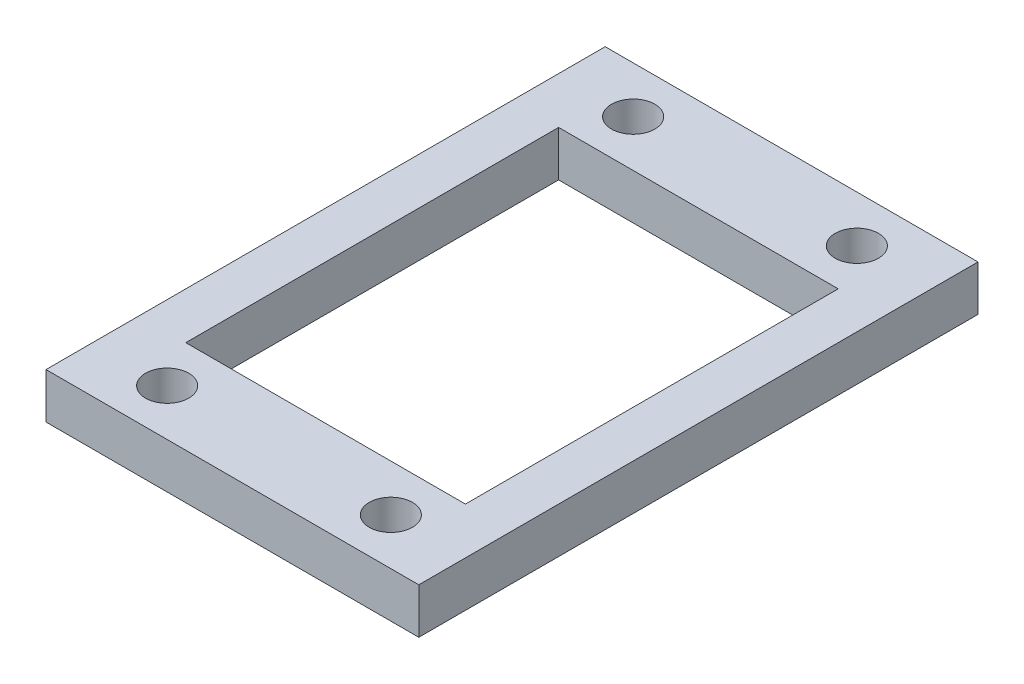
ISO-10303-21;
HEADER;
FILE_DESCRIPTION(('STEP AP214'),'2;1');
FILE_NAME('part.step','',(''),(''),'','','');
FILE_SCHEMA(('AUTOMOTIVE_DESIGN { 1 0 10303 214 1 1 1 1 }'));
ENDSEC;
DATA;
#1=APPLICATION_CONTEXT('core data for automotive mechanical design processes');
#2=APPLICATION_PROTOCOL_DEFINITION('international standard','automotive_design',2000,#1);
#3=PRODUCT_CONTEXT('',#1,'mechanical');
#4=PRODUCT('Part','Part','',(#3));
#5=PRODUCT_RELATED_PRODUCT_CATEGORY('part','',(#4));
#6=PRODUCT_DEFINITION_FORMATION('','',#4);
#7=PRODUCT_DEFINITION_CONTEXT('part definition',#1,'design');
#8=PRODUCT_DEFINITION('design','',#6,#7);
#9=PRODUCT_DEFINITION_SHAPE('','',#8);
#10=(LENGTH_UNIT() NAMED_UNIT(*) SI_UNIT(.MILLI.,.METRE.));
#11=(NAMED_UNIT(*) PLANE_ANGLE_UNIT() SI_UNIT($,.RADIAN.));
#12=(NAMED_UNIT(*) SI_UNIT($,.STERADIAN.) SOLID_ANGLE_UNIT());
#13=UNCERTAINTY_MEASURE_WITH_UNIT(LENGTH_MEASURE(1.E-05),#10,'distance_accuracy_value','');
#14=(GEOMETRIC_REPRESENTATION_CONTEXT(3) GLOBAL_UNCERTAINTY_ASSIGNED_CONTEXT((#13)) GLOBAL_UNIT_ASSIGNED_CONTEXT((#10,
#11,#12)) REPRESENTATION_CONTEXT('',''));
#15=CARTESIAN_POINT('',(0.,0.,0.));
#16=DIRECTION('',(0.,0.,1.));
#17=DIRECTION('',(1.,0.,0.));
#18=AXIS2_PLACEMENT_3D('',#15,#16,#17);
#19=CARTESIAN_POINT('',(-25.4,3.0988,19.05));
#20=DIRECTION('',(0.,1.,0.));
#21=DIRECTION('',(0.,0.,1.));
#22=AXIS2_PLACEMENT_3D('',#19,#20,#21);
#23=PLANE('',#22);
#24=CARTESIAN_POINT('',(-5.08000000000001,3.0988,15.875));
#25=DIRECTION('',(0.,1.,0.));
#26=DIRECTION('',(0.,0.,-1.));
#27=AXIS2_PLACEMENT_3D('',#24,#25,#26);
#28=CIRCLE('',#27,1.4732);
#29=CARTESIAN_POINT('',(-5.08000000000001,3.0988,14.4018));
#30=VERTEX_POINT('',#29);
#31=EDGE_CURVE('E133',#30,#30,#28,.T.);
#32=ORIENTED_EDGE('',*,*,#31,.F.);
#33=EDGE_LOOP('',(#32));
#34=FACE_BOUND('',#33,.T.);
#35=CARTESIAN_POINT('',(-20.32,3.0988,15.875));
#36=DIRECTION('',(0.,1.,0.));
#37=DIRECTION('',(0.,0.,1.));
#38=AXIS2_PLACEMENT_3D('',#35,#36,#37);
#39=CIRCLE('',#38,1.4732);
#40=CARTESIAN_POINT('',(-20.32,3.0988,17.3482));
#41=VERTEX_POINT('',#40);
#42=EDGE_CURVE('E145',#41,#41,#39,.T.);
#43=ORIENTED_EDGE('',*,*,#42,.F.);
#44=EDGE_LOOP('',(#43));
#45=FACE_BOUND('',#44,.T.);
#46=DIRECTION('',(0.,0.,1.));
#47=VECTOR('',#46,1.);
#48=CARTESIAN_POINT('',(-25.4,3.0988,-19.05));
#49=LINE('',#48,#47);
#50=CARTESIAN_POINT('',(-25.4,3.0988,-19.05));
#51=VERTEX_POINT('',#50);
#52=CARTESIAN_POINT('',(-25.4,3.0988,19.05));
#53=VERTEX_POINT('',#52);
#54=EDGE_CURVE('E157',#51,#53,#49,.T.);
#55=ORIENTED_EDGE('',*,*,#54,.T.);
#56=DIRECTION('',(1.,0.,0.));
#57=VECTOR('',#56,1.);
#58=CARTESIAN_POINT('',(-25.4,3.0988,19.05));
#59=LINE('',#58,#57);
#60=CARTESIAN_POINT('',(0.,3.0988,19.05));
#61=VERTEX_POINT('',#60);
#62=EDGE_CURVE('E160',#53,#61,#59,.T.);
#63=ORIENTED_EDGE('',*,*,#62,.T.);
#64=DIRECTION('',(0.,0.,-1.));
#65=VECTOR('',#64,1.);
#66=CARTESIAN_POINT('',(0.,3.0988,-19.05));
#67=LINE('',#66,#65);
#68=CARTESIAN_POINT('',(0.,3.0988,-19.05));
#69=VERTEX_POINT('',#68);
#70=EDGE_CURVE('E163',#61,#69,#67,.T.);
#71=ORIENTED_EDGE('',*,*,#70,.T.);
#72=DIRECTION('',(-1.,0.,0.));
#73=VECTOR('',#72,1.);
#74=CARTESIAN_POINT('',(-25.4,3.0988,-19.05));
#75=LINE('',#74,#73);
#76=EDGE_CURVE('E165',#69,#51,#75,.T.);
#77=ORIENTED_EDGE('',*,*,#76,.T.);
#78=EDGE_LOOP('',(#55,#63,#71,#77));
#79=FACE_BOUND('',#78,.T.);
#80=CARTESIAN_POINT('',(-5.08000000000001,3.0988,-15.875));
#81=DIRECTION('',(0.,1.,0.));
#82=DIRECTION('',(0.,0.,1.));
#83=AXIS2_PLACEMENT_3D('',#80,#81,#82);
#84=CIRCLE('',#83,1.4732);
#85=CARTESIAN_POINT('',(-5.08000000000001,3.0988,-14.4018));
#86=VERTEX_POINT('',#85);
#87=EDGE_CURVE('E151',#86,#86,#84,.T.);
#88=ORIENTED_EDGE('',*,*,#87,.F.);
#89=EDGE_LOOP('',(#88));
#90=FACE_BOUND('',#89,.T.);
#91=CARTESIAN_POINT('',(-20.32,3.0988,-15.875));
#92=DIRECTION('',(0.,1.,0.));
#93=DIRECTION('',(0.,0.,-1.));
#94=AXIS2_PLACEMENT_3D('',#91,#92,#93);
#95=CIRCLE('',#94,1.4732);
#96=CARTESIAN_POINT('',(-20.32,3.0988,-17.3482));
#97=VERTEX_POINT('',#96);
#98=EDGE_CURVE('E139',#97,#97,#95,.T.);
#99=ORIENTED_EDGE('',*,*,#98,.F.);
#100=EDGE_LOOP('',(#99));
#101=FACE_BOUND('',#100,.T.);
#102=DIRECTION('',(-1.,0.,0.));
#103=VECTOR('',#102,1.);
#104=CARTESIAN_POINT('',(-22.225,3.0988,-12.7));
#105=LINE('',#104,#103);
#106=CARTESIAN_POINT('',(-3.17500000000001,3.0988,-12.7));
#107=VERTEX_POINT('',#106);
#108=CARTESIAN_POINT('',(-22.225,3.0988,-12.7));
#109=VERTEX_POINT('',#108);
#110=EDGE_CURVE('E105',#107,#109,#105,.T.);
#111=ORIENTED_EDGE('',*,*,#110,.F.);
#112=DIRECTION('',(0.,0.,-1.));
#113=VECTOR('',#112,1.);
#114=CARTESIAN_POINT('',(-3.175,3.0988,12.7));
#115=LINE('',#114,#113);
#116=CARTESIAN_POINT('',(-3.175,3.0988,12.7));
#117=VERTEX_POINT('',#116);
#118=EDGE_CURVE('E97',#117,#107,#115,.T.);
#119=ORIENTED_EDGE('',*,*,#118,.F.);
#120=DIRECTION('',(1.,0.,0.));
#121=VECTOR('',#120,1.);
#122=CARTESIAN_POINT('',(-22.225,3.0988,12.7));
#123=LINE('',#122,#121);
#124=CARTESIAN_POINT('',(-22.225,3.0988,12.7));
#125=VERTEX_POINT('',#124);
#126=EDGE_CURVE('E119',#125,#117,#123,.T.);
#127=ORIENTED_EDGE('',*,*,#126,.F.);
#128=DIRECTION('',(0.,0.,1.));
#129=VECTOR('',#128,1.);
#130=CARTESIAN_POINT('',(-22.225,3.0988,12.7));
#131=LINE('',#130,#129);
#132=EDGE_CURVE('E117',#109,#125,#131,.T.);
#133=ORIENTED_EDGE('',*,*,#132,.F.);
#134=EDGE_LOOP('',(#111,#119,#127,#133));
#135=FACE_BOUND('',#134,.T.);
#136=ADVANCED_FACE('F32',(#34,#45,#79,#90,#101,#135),#23,.T.);
#137=CARTESIAN_POINT('',(-25.4,0.,19.05));
#138=DIRECTION('',(0.,1.,0.));
#139=DIRECTION('',(0.,0.,1.));
#140=AXIS2_PLACEMENT_3D('',#137,#138,#139);
#141=PLANE('',#140);
#142=CARTESIAN_POINT('',(-5.08000000000001,0.,15.875));
#143=DIRECTION('',(0.,1.,0.));
#144=DIRECTION('',(0.,0.,-1.));
#145=AXIS2_PLACEMENT_3D('',#142,#143,#144);
#146=CIRCLE('',#145,1.4732);
#147=CARTESIAN_POINT('',(-5.08000000000001,0.,14.4018));
#148=VERTEX_POINT('',#147);
#149=EDGE_CURVE('E113',#148,#148,#146,.T.);
#150=ORIENTED_EDGE('',*,*,#149,.T.);
#151=EDGE_LOOP('',(#150));
#152=FACE_BOUND('',#151,.T.);
#153=CARTESIAN_POINT('',(-20.32,0.,15.875));
#154=DIRECTION('',(0.,1.,0.));
#155=DIRECTION('',(0.,0.,1.));
#156=AXIS2_PLACEMENT_3D('',#153,#154,#155);
#157=CIRCLE('',#156,1.4732);
#158=CARTESIAN_POINT('',(-20.32,0.,17.3482));
#159=VERTEX_POINT('',#158);
#160=EDGE_CURVE('E142',#159,#159,#157,.T.);
#161=ORIENTED_EDGE('',*,*,#160,.T.);
#162=EDGE_LOOP('',(#161));
#163=FACE_BOUND('',#162,.T.);
#164=DIRECTION('',(0.,0.,1.));
#165=VECTOR('',#164,1.);
#166=CARTESIAN_POINT('',(-25.4,0.,-19.05));
#167=LINE('',#166,#165);
#168=CARTESIAN_POINT('',(-25.4,0.,-19.05));
#169=VERTEX_POINT('',#168);
#170=CARTESIAN_POINT('',(-25.4,0.,19.05));
#171=VERTEX_POINT('',#170);
#172=EDGE_CURVE('E154',#169,#171,#167,.T.);
#173=ORIENTED_EDGE('',*,*,#172,.F.);
#174=DIRECTION('',(-1.,0.,0.));
#175=VECTOR('',#174,1.);
#176=CARTESIAN_POINT('',(-25.4,0.,-19.05));
#177=LINE('',#176,#175);
#178=CARTESIAN_POINT('',(0.,0.,-19.05));
#179=VERTEX_POINT('',#178);
#180=EDGE_CURVE('E161',#179,#169,#177,.T.);
#181=ORIENTED_EDGE('',*,*,#180,.F.);
#182=DIRECTION('',(0.,0.,-1.));
#183=VECTOR('',#182,1.);
#184=CARTESIAN_POINT('',(0.,0.,-19.05));
#185=LINE('',#184,#183);
#186=CARTESIAN_POINT('',(0.,0.,19.05));
#187=VERTEX_POINT('',#186);
#188=EDGE_CURVE('E172',#187,#179,#185,.T.);
#189=ORIENTED_EDGE('',*,*,#188,.F.);
#190=DIRECTION('',(1.,0.,0.));
#191=VECTOR('',#190,1.);
#192=CARTESIAN_POINT('',(-25.4,0.,19.05));
#193=LINE('',#192,#191);
#194=EDGE_CURVE('E170',#171,#187,#193,.T.);
#195=ORIENTED_EDGE('',*,*,#194,.F.);
#196=EDGE_LOOP('',(#173,#181,#189,#195));
#197=FACE_BOUND('',#196,.T.);
#198=CARTESIAN_POINT('',(-5.08000000000001,0.,-15.875));
#199=DIRECTION('',(0.,1.,0.));
#200=DIRECTION('',(0.,0.,1.));
#201=AXIS2_PLACEMENT_3D('',#198,#199,#200);
#202=CIRCLE('',#201,1.4732);
#203=CARTESIAN_POINT('',(-5.08000000000001,0.,-14.4018));
#204=VERTEX_POINT('',#203);
#205=EDGE_CURVE('E148',#204,#204,#202,.T.);
#206=ORIENTED_EDGE('',*,*,#205,.T.);
#207=EDGE_LOOP('',(#206));
#208=FACE_BOUND('',#207,.T.);
#209=CARTESIAN_POINT('',(-20.32,0.,-15.875));
#210=DIRECTION('',(0.,1.,0.));
#211=DIRECTION('',(0.,0.,-1.));
#212=AXIS2_PLACEMENT_3D('',#209,#210,#211);
#213=CIRCLE('',#212,1.4732);
#214=CARTESIAN_POINT('',(-20.32,0.,-17.3482));
#215=VERTEX_POINT('',#214);
#216=EDGE_CURVE('E136',#215,#215,#213,.T.);
#217=ORIENTED_EDGE('',*,*,#216,.T.);
#218=EDGE_LOOP('',(#217));
#219=FACE_BOUND('',#218,.T.);
#220=DIRECTION('',(0.,0.,-1.));
#221=VECTOR('',#220,1.);
#222=CARTESIAN_POINT('',(-3.175,0.,12.7));
#223=LINE('',#222,#221);
#224=CARTESIAN_POINT('',(-3.175,0.,12.7));
#225=VERTEX_POINT('',#224);
#226=CARTESIAN_POINT('',(-3.17500000000001,0.,-12.7));
#227=VERTEX_POINT('',#226);
#228=EDGE_CURVE('E55',#225,#227,#223,.T.);
#229=ORIENTED_EDGE('',*,*,#228,.T.);
#230=DIRECTION('',(-1.,0.,0.));
#231=VECTOR('',#230,1.);
#232=CARTESIAN_POINT('',(-22.225,0.,-12.7));
#233=LINE('',#232,#231);
#234=CARTESIAN_POINT('',(-22.225,0.,-12.7));
#235=VERTEX_POINT('',#234);
#236=EDGE_CURVE('E112',#227,#235,#233,.T.);
#237=ORIENTED_EDGE('',*,*,#236,.T.);
#238=DIRECTION('',(0.,0.,1.));
#239=VECTOR('',#238,1.);
#240=CARTESIAN_POINT('',(-22.225,0.,12.7));
#241=LINE('',#240,#239);
#242=CARTESIAN_POINT('',(-22.225,0.,12.7));
#243=VERTEX_POINT('',#242);
#244=EDGE_CURVE('E125',#235,#243,#241,.T.);
#245=ORIENTED_EDGE('',*,*,#244,.T.);
#246=DIRECTION('',(1.,0.,0.));
#247=VECTOR('',#246,1.);
#248=CARTESIAN_POINT('',(-22.225,0.,12.7));
#249=LINE('',#248,#247);
#250=EDGE_CURVE('E106',#243,#225,#249,.T.);
#251=ORIENTED_EDGE('',*,*,#250,.T.);
#252=EDGE_LOOP('',(#229,#237,#245,#251));
#253=FACE_BOUND('',#252,.T.);
#254=ADVANCED_FACE('F190',(#152,#163,#197,#208,#219,#253),#141,.F.);
#255=CARTESIAN_POINT('',(-25.4,3.0988,-19.05));
#256=DIRECTION('',(1.,0.,0.));
#257=DIRECTION('',(0.,0.,-1.));
#258=AXIS2_PLACEMENT_3D('',#255,#256,#257);
#259=PLANE('',#258);
#260=ORIENTED_EDGE('',*,*,#172,.T.);
#261=DIRECTION('',(0.,-1.,0.));
#262=VECTOR('',#261,1.);
#263=CARTESIAN_POINT('',(-25.4,3.0988,19.05));
#264=LINE('',#263,#262);
#265=EDGE_CURVE('E11',#53,#171,#264,.T.);
#266=ORIENTED_EDGE('',*,*,#265,.F.);
#267=ORIENTED_EDGE('',*,*,#54,.F.);
#268=DIRECTION('',(0.,-1.,0.));
#269=VECTOR('',#268,1.);
#270=CARTESIAN_POINT('',(-25.4,3.0988,-19.05));
#271=LINE('',#270,#269);
#272=EDGE_CURVE('E167',#51,#169,#271,.T.);
#273=ORIENTED_EDGE('',*,*,#272,.T.);
#274=EDGE_LOOP('',(#260,#266,#267,#273));
#275=FACE_BOUND('',#274,.T.);
#276=ADVANCED_FACE('F34',(#275),#259,.F.);
#277=CARTESIAN_POINT('',(-25.4,3.0988,19.05));
#278=DIRECTION('',(0.,0.,-1.));
#279=DIRECTION('',(-1.,0.,0.));
#280=AXIS2_PLACEMENT_3D('',#277,#278,#279);
#281=PLANE('',#280);
#282=ORIENTED_EDGE('',*,*,#194,.T.);
#283=DIRECTION('',(0.,-1.,0.));
#284=VECTOR('',#283,1.);
#285=CARTESIAN_POINT('',(0.,3.0988,19.05));
#286=LINE('',#285,#284);
#287=EDGE_CURVE('E40',#61,#187,#286,.T.);
#288=ORIENTED_EDGE('',*,*,#287,.F.);
#289=ORIENTED_EDGE('',*,*,#62,.F.);
#290=ORIENTED_EDGE('',*,*,#265,.T.);
#291=EDGE_LOOP('',(#282,#288,#289,#290));
#292=FACE_BOUND('',#291,.T.);
#293=ADVANCED_FACE('F201',(#292),#281,.F.);
#294=CARTESIAN_POINT('',(0.,3.0988,-19.05));
#295=DIRECTION('',(-1.,0.,0.));
#296=DIRECTION('',(0.,0.,1.));
#297=AXIS2_PLACEMENT_3D('',#294,#295,#296);
#298=PLANE('',#297);
#299=ORIENTED_EDGE('',*,*,#188,.T.);
#300=DIRECTION('',(0.,-1.,0.));
#301=VECTOR('',#300,1.);
#302=CARTESIAN_POINT('',(0.,3.0988,-19.05));
#303=LINE('',#302,#301);
#304=EDGE_CURVE('E177',#69,#179,#303,.T.);
#305=ORIENTED_EDGE('',*,*,#304,.F.);
#306=ORIENTED_EDGE('',*,*,#70,.F.);
#307=ORIENTED_EDGE('',*,*,#287,.T.);
#308=EDGE_LOOP('',(#299,#305,#306,#307));
#309=FACE_BOUND('',#308,.T.);
#310=ADVANCED_FACE('F184',(#309),#298,.F.);
#311=CARTESIAN_POINT('',(-25.4,3.0988,-19.05));
#312=DIRECTION('',(0.,0.,1.));
#313=DIRECTION('',(1.,0.,0.));
#314=AXIS2_PLACEMENT_3D('',#311,#312,#313);
#315=PLANE('',#314);
#316=ORIENTED_EDGE('',*,*,#180,.T.);
#317=ORIENTED_EDGE('',*,*,#272,.F.);
#318=ORIENTED_EDGE('',*,*,#76,.F.);
#319=ORIENTED_EDGE('',*,*,#304,.T.);
#320=EDGE_LOOP('',(#316,#317,#318,#319));
#321=FACE_BOUND('',#320,.T.);
#322=ADVANCED_FACE('F194',(#321),#315,.F.);
#323=CARTESIAN_POINT('',(-5.08000000000001,3.0988,-15.875));
#324=DIRECTION('',(0.,-1.,0.));
#325=DIRECTION('',(0.,0.,-1.));
#326=AXIS2_PLACEMENT_3D('',#323,#324,#325);
#327=CYLINDRICAL_SURFACE('',#326,1.4732);
#328=ORIENTED_EDGE('',*,*,#87,.T.);
#329=EDGE_LOOP('',(#328));
#330=FACE_BOUND('',#329,.T.);
#331=ORIENTED_EDGE('',*,*,#205,.F.);
#332=EDGE_LOOP('',(#331));
#333=FACE_BOUND('',#332,.T.);
#334=ADVANCED_FACE('F219',(#330,#333),#327,.F.);
#335=CARTESIAN_POINT('',(-20.32,3.0988,15.875));
#336=DIRECTION('',(0.,-1.,0.));
#337=DIRECTION('',(0.,0.,-1.));
#338=AXIS2_PLACEMENT_3D('',#335,#336,#337);
#339=CYLINDRICAL_SURFACE('',#338,1.4732);
#340=ORIENTED_EDGE('',*,*,#42,.T.);
#341=EDGE_LOOP('',(#340));
#342=FACE_BOUND('',#341,.T.);
#343=ORIENTED_EDGE('',*,*,#160,.F.);
#344=EDGE_LOOP('',(#343));
#345=FACE_BOUND('',#344,.T.);
#346=ADVANCED_FACE('F226',(#342,#345),#339,.F.);
#347=CARTESIAN_POINT('',(-20.32,3.0988,-15.875));
#348=DIRECTION('',(0.,-1.,0.));
#349=DIRECTION('',(0.,0.,-1.));
#350=AXIS2_PLACEMENT_3D('',#347,#348,#349);
#351=CYLINDRICAL_SURFACE('',#350,1.4732);
#352=ORIENTED_EDGE('',*,*,#98,.T.);
#353=EDGE_LOOP('',(#352));
#354=FACE_BOUND('',#353,.T.);
#355=ORIENTED_EDGE('',*,*,#216,.F.);
#356=EDGE_LOOP('',(#355));
#357=FACE_BOUND('',#356,.T.);
#358=ADVANCED_FACE('F231',(#354,#357),#351,.F.);
#359=CARTESIAN_POINT('',(-5.08000000000001,3.0988,15.875));
#360=DIRECTION('',(0.,-1.,0.));
#361=DIRECTION('',(0.,0.,-1.));
#362=AXIS2_PLACEMENT_3D('',#359,#360,#361);
#363=CYLINDRICAL_SURFACE('',#362,1.4732);
#364=ORIENTED_EDGE('',*,*,#31,.T.);
#365=EDGE_LOOP('',(#364));
#366=FACE_BOUND('',#365,.T.);
#367=ORIENTED_EDGE('',*,*,#149,.F.);
#368=EDGE_LOOP('',(#367));
#369=FACE_BOUND('',#368,.T.);
#370=ADVANCED_FACE('F254',(#366,#369),#363,.F.);
#371=CARTESIAN_POINT('',(-3.175,3.0988,12.7));
#372=DIRECTION('',(-1.,0.,0.));
#373=DIRECTION('',(0.,0.,1.));
#374=AXIS2_PLACEMENT_3D('',#371,#372,#373);
#375=PLANE('',#374);
#376=ORIENTED_EDGE('',*,*,#228,.F.);
#377=DIRECTION('',(0.,-1.,0.));
#378=VECTOR('',#377,1.);
#379=CARTESIAN_POINT('',(-3.175,3.0988,12.7));
#380=LINE('',#379,#378);
#381=EDGE_CURVE('E101',#117,#225,#380,.T.);
#382=ORIENTED_EDGE('',*,*,#381,.F.);
#383=ORIENTED_EDGE('',*,*,#118,.T.);
#384=DIRECTION('',(0.,-1.,0.));
#385=VECTOR('',#384,1.);
#386=CARTESIAN_POINT('',(-3.17500000000001,3.0988,-12.7));
#387=LINE('',#386,#385);
#388=EDGE_CURVE('E100',#107,#227,#387,.T.);
#389=ORIENTED_EDGE('',*,*,#388,.T.);
#390=EDGE_LOOP('',(#376,#382,#383,#389));
#391=FACE_BOUND('',#390,.T.);
#392=ADVANCED_FACE('F99',(#391),#375,.T.);
#393=CARTESIAN_POINT('',(-22.225,3.0988,-12.7));
#394=DIRECTION('',(0.,0.,1.));
#395=DIRECTION('',(1.,0.,0.));
#396=AXIS2_PLACEMENT_3D('',#393,#394,#395);
#397=PLANE('',#396);
#398=ORIENTED_EDGE('',*,*,#236,.F.);
#399=ORIENTED_EDGE('',*,*,#388,.F.);
#400=ORIENTED_EDGE('',*,*,#110,.T.);
#401=DIRECTION('',(0.,-1.,0.));
#402=VECTOR('',#401,1.);
#403=CARTESIAN_POINT('',(-22.225,3.0988,-12.7));
#404=LINE('',#403,#402);
#405=EDGE_CURVE('E114',#109,#235,#404,.T.);
#406=ORIENTED_EDGE('',*,*,#405,.T.);
#407=EDGE_LOOP('',(#398,#399,#400,#406));
#408=FACE_BOUND('',#407,.T.);
#409=ADVANCED_FACE('F109',(#408),#397,.T.);
#410=CARTESIAN_POINT('',(-22.225,3.0988,12.7));
#411=DIRECTION('',(1.,0.,0.));
#412=DIRECTION('',(0.,0.,-1.));
#413=AXIS2_PLACEMENT_3D('',#410,#411,#412);
#414=PLANE('',#413);
#415=ORIENTED_EDGE('',*,*,#244,.F.);
#416=ORIENTED_EDGE('',*,*,#405,.F.);
#417=ORIENTED_EDGE('',*,*,#132,.T.);
#418=DIRECTION('',(0.,-1.,0.));
#419=VECTOR('',#418,1.);
#420=CARTESIAN_POINT('',(-22.225,3.0988,12.7));
#421=LINE('',#420,#419);
#422=EDGE_CURVE('E47',#125,#243,#421,.T.);
#423=ORIENTED_EDGE('',*,*,#422,.T.);
#424=EDGE_LOOP('',(#415,#416,#417,#423));
#425=FACE_BOUND('',#424,.T.);
#426=ADVANCED_FACE('F242',(#425),#414,.T.);
#427=CARTESIAN_POINT('',(-22.225,3.0988,12.7));
#428=DIRECTION('',(0.,0.,-1.));
#429=DIRECTION('',(-1.,0.,0.));
#430=AXIS2_PLACEMENT_3D('',#427,#428,#429);
#431=PLANE('',#430);
#432=ORIENTED_EDGE('',*,*,#250,.F.);
#433=ORIENTED_EDGE('',*,*,#422,.F.);
#434=ORIENTED_EDGE('',*,*,#126,.T.);
#435=ORIENTED_EDGE('',*,*,#381,.T.);
#436=EDGE_LOOP('',(#432,#433,#434,#435));
#437=FACE_BOUND('',#436,.T.);
#438=ADVANCED_FACE('F240',(#437),#431,.T.);
#439=CLOSED_SHELL('',(#136,#254,#276,#293,#310,#322,#334,#346,#358,#370,#392,#409,#426,#438));
#440=MANIFOLD_SOLID_BREP('B2',#439);
#441=ADVANCED_BREP_SHAPE_REPRESENTATION('',(#18,#440),#14);
#442=SHAPE_DEFINITION_REPRESENTATION(#9,#441);
ENDSEC;
END-ISO-10303-21;
